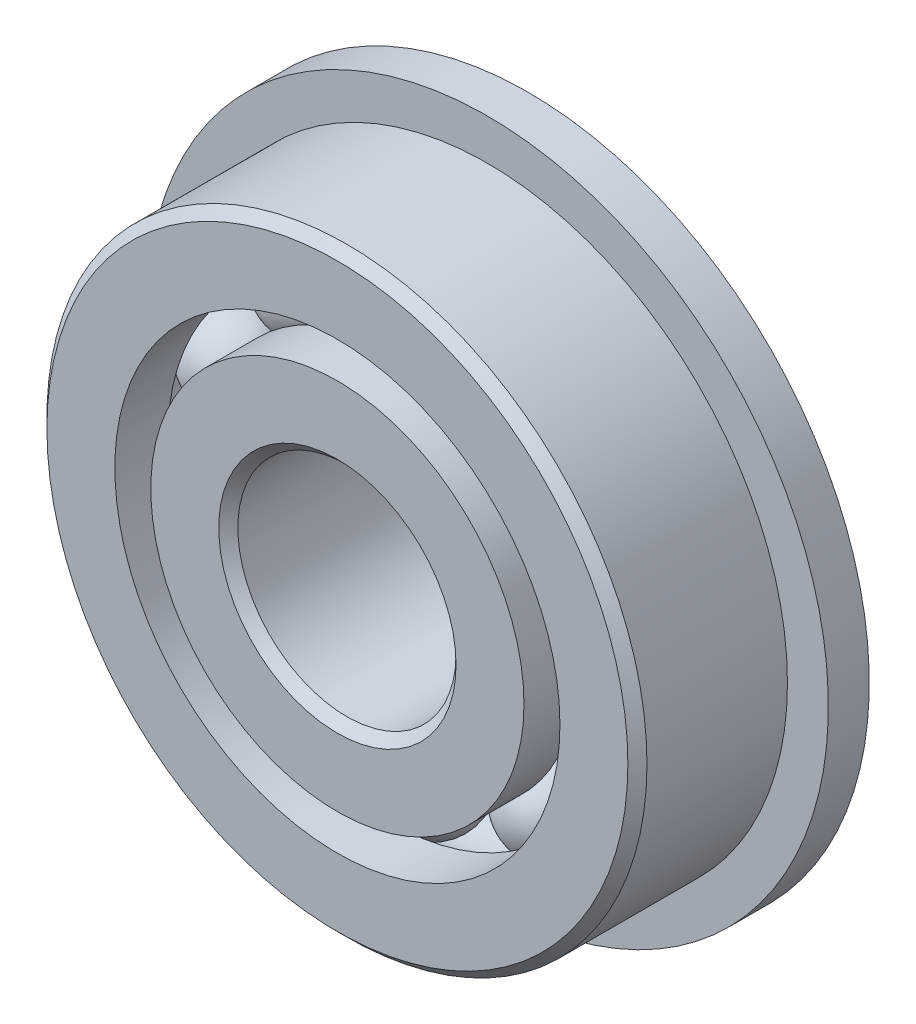
ISO-10303-21;
HEADER;
FILE_DESCRIPTION(('STEP AP214'),'2;1');
FILE_NAME('part.step','',(''),(''),'','','');
FILE_SCHEMA(('AUTOMOTIVE_DESIGN { 1 0 10303 214 1 1 1 1 }'));
ENDSEC;
DATA;
#1=APPLICATION_CONTEXT('core data for automotive mechanical design processes');
#2=APPLICATION_PROTOCOL_DEFINITION('international standard','automotive_design',2000,#1);
#3=PRODUCT_CONTEXT('',#1,'mechanical');
#4=PRODUCT('Part','Part','',(#3));
#5=PRODUCT_RELATED_PRODUCT_CATEGORY('part','',(#4));
#6=PRODUCT_DEFINITION_FORMATION('','',#4);
#7=PRODUCT_DEFINITION_CONTEXT('part definition',#1,'design');
#8=PRODUCT_DEFINITION('design','',#6,#7);
#9=PRODUCT_DEFINITION_SHAPE('','',#8);
#10=(LENGTH_UNIT() NAMED_UNIT(*) SI_UNIT(.MILLI.,.METRE.));
#11=(NAMED_UNIT(*) PLANE_ANGLE_UNIT() SI_UNIT($,.RADIAN.));
#12=(NAMED_UNIT(*) SI_UNIT($,.STERADIAN.) SOLID_ANGLE_UNIT());
#13=UNCERTAINTY_MEASURE_WITH_UNIT(LENGTH_MEASURE(1.E-05),#10,'distance_accuracy_value','');
#14=(GEOMETRIC_REPRESENTATION_CONTEXT(3) GLOBAL_UNCERTAINTY_ASSIGNED_CONTEXT((#13)) GLOBAL_UNIT_ASSIGNED_CONTEXT((#10,
#11,#12)) REPRESENTATION_CONTEXT('',''));
#15=CARTESIAN_POINT('',(0.,0.,0.));
#16=DIRECTION('',(0.,0.,1.));
#17=DIRECTION('',(1.,0.,0.));
#18=AXIS2_PLACEMENT_3D('',#15,#16,#17);
#19=CARTESIAN_POINT('',(-4.40838939219347,6.06762745781216,0.));
#20=DIRECTION('',(0.,0.,1.));
#21=DIRECTION('',(-0.587785252292462,0.809016994374955,0.));
#22=AXIS2_PLACEMENT_3D('',#19,#20,#21);
#23=SPHERICAL_SURFACE('',#22,1.68952158656808);
#24=CARTESIAN_POINT('',(-4.40838939219347,6.06762745781216,1.68952158656808));
#25=VERTEX_POINT('',#24);
#26=VERTEX_LOOP('',#25);
#27=FACE_BOUND('',#26,.T.);
#28=ADVANCED_FACE('F37',(#27),#23,.T.);
#29=CLOSED_SHELL('',(#28));
#30=MANIFOLD_SOLID_BREP('B2',#29);
#31=CARTESIAN_POINT('',(-7.13292387221363,2.31762745781219,0.));
#32=DIRECTION('',(0.,0.,1.));
#33=DIRECTION('',(-0.95105651629515,0.309016994374958,0.));
#34=AXIS2_PLACEMENT_3D('',#31,#32,#33);
#35=SPHERICAL_SURFACE('',#34,1.68952158656808);
#36=CARTESIAN_POINT('',(-7.13292387221363,2.31762745781219,1.68952158656808));
#37=VERTEX_POINT('',#36);
#38=VERTEX_LOOP('',#37);
#39=FACE_BOUND('',#38,.T.);
#40=ADVANCED_FACE('F57',(#39),#35,.T.);
#41=CLOSED_SHELL('',(#40));
#42=MANIFOLD_SOLID_BREP('B6',#41);
#43=CARTESIAN_POINT('',(-7.13292387221367,-2.31762745781204,0.));
#44=DIRECTION('',(0.,0.,1.));
#45=DIRECTION('',(-0.951056516295157,-0.309016994374938,0.));
#46=AXIS2_PLACEMENT_3D('',#43,#44,#45);
#47=SPHERICAL_SURFACE('',#46,1.68952158656808);
#48=CARTESIAN_POINT('',(-7.13292387221367,-2.31762745781204,1.68952158656808));
#49=VERTEX_POINT('',#48);
#50=VERTEX_LOOP('',#49);
#51=FACE_BOUND('',#50,.T.);
#52=ADVANCED_FACE('F77',(#51),#47,.T.);
#53=CLOSED_SHELL('',(#52));
#54=MANIFOLD_SOLID_BREP('B33',#53);
#55=CARTESIAN_POINT('',(-4.4083893921936,-6.06762745781207,0.));
#56=DIRECTION('',(0.,0.,1.));
#57=DIRECTION('',(-0.58778525229248,-0.809016994374942,0.));
#58=AXIS2_PLACEMENT_3D('',#55,#56,#57);
#59=SPHERICAL_SURFACE('',#58,1.68952158656808);
#60=CARTESIAN_POINT('',(-4.4083893921936,-6.06762745781207,1.68952158656808));
#61=VERTEX_POINT('',#60);
#62=VERTEX_LOOP('',#61);
#63=FACE_BOUND('',#62,.T.);
#64=ADVANCED_FACE('F97',(#63),#59,.T.);
#65=CLOSED_SHELL('',(#64));
#66=MANIFOLD_SOLID_BREP('B53',#65);
#67=CARTESIAN_POINT('',(0.,-7.5,0.));
#68=DIRECTION('',(0.,0.,1.));
#69=DIRECTION('',(0.,-1.,0.));
#70=AXIS2_PLACEMENT_3D('',#67,#68,#69);
#71=SPHERICAL_SURFACE('',#70,1.68952158656808);
#72=CARTESIAN_POINT('',(0.,-7.5,1.68952158656808));
#73=VERTEX_POINT('',#72);
#74=VERTEX_LOOP('',#73);
#75=FACE_BOUND('',#74,.T.);
#76=ADVANCED_FACE('F117',(#75),#71,.T.);
#77=CLOSED_SHELL('',(#76));
#78=MANIFOLD_SOLID_BREP('B73',#77);
#79=CARTESIAN_POINT('',(4.40838939219351,-6.06762745781213,0.));
#80=DIRECTION('',(0.,0.,1.));
#81=DIRECTION('',(0.587785252292469,-0.809016994374951,0.));
#82=AXIS2_PLACEMENT_3D('',#79,#80,#81);
#83=SPHERICAL_SURFACE('',#82,1.68952158656808);
#84=CARTESIAN_POINT('',(4.40838939219351,-6.06762745781213,1.68952158656808));
#85=VERTEX_POINT('',#84);
#86=VERTEX_LOOP('',#85);
#87=FACE_BOUND('',#86,.T.);
#88=ADVANCED_FACE('F137',(#87),#83,.T.);
#89=CLOSED_SHELL('',(#88));
#90=MANIFOLD_SOLID_BREP('B93',#89);
#91=CARTESIAN_POINT('',(7.13292387221364,-2.31762745781214,0.));
#92=DIRECTION('',(0.,0.,1.));
#93=DIRECTION('',(0.951056516295152,-0.309016994374952,0.));
#94=AXIS2_PLACEMENT_3D('',#91,#92,#93);
#95=SPHERICAL_SURFACE('',#94,1.68952158656808);
#96=CARTESIAN_POINT('',(7.13292387221364,-2.31762745781214,1.68952158656808));
#97=VERTEX_POINT('',#96);
#98=VERTEX_LOOP('',#97);
#99=FACE_BOUND('',#98,.T.);
#100=ADVANCED_FACE('F157',(#99),#95,.T.);
#101=CLOSED_SHELL('',(#100));
#102=MANIFOLD_SOLID_BREP('B113',#101);
#103=CARTESIAN_POINT('',(7.13292387221366,2.31762745781209,0.));
#104=DIRECTION('',(0.,0.,1.));
#105=DIRECTION('',(0.951056516295155,0.309016994374945,0.));
#106=AXIS2_PLACEMENT_3D('',#103,#104,#105);
#107=SPHERICAL_SURFACE('',#106,1.68952158656808);
#108=CARTESIAN_POINT('',(7.13292387221366,2.31762745781209,1.68952158656808));
#109=VERTEX_POINT('',#108);
#110=VERTEX_LOOP('',#109);
#111=FACE_BOUND('',#110,.T.);
#112=ADVANCED_FACE('F177',(#111),#107,.T.);
#113=CLOSED_SHELL('',(#112));
#114=MANIFOLD_SOLID_BREP('B133',#113);
#115=CARTESIAN_POINT('',(4.40838939219356,6.0676274578121,0.));
#116=DIRECTION('',(0.,0.,1.));
#117=DIRECTION('',(0.587785252292474,0.809016994374947,0.));
#118=AXIS2_PLACEMENT_3D('',#115,#116,#117);
#119=SPHERICAL_SURFACE('',#118,1.68952158656808);
#120=CARTESIAN_POINT('',(4.40838939219356,6.0676274578121,1.68952158656808));
#121=VERTEX_POINT('',#120);
#122=VERTEX_LOOP('',#121);
#123=FACE_BOUND('',#122,.T.);
#124=ADVANCED_FACE('F197',(#123),#119,.T.);
#125=CLOSED_SHELL('',(#124));
#126=MANIFOLD_SOLID_BREP('B153',#125);
#127=CARTESIAN_POINT('',(0.,7.5,0.));
#128=DIRECTION('',(0.,0.,1.));
#129=DIRECTION('',(0.,1.,0.));
#130=AXIS2_PLACEMENT_3D('',#127,#128,#129);
#131=SPHERICAL_SURFACE('',#130,1.68952158656808);
#132=CARTESIAN_POINT('',(0.,7.5,1.68952158656808));
#133=VERTEX_POINT('',#132);
#134=VERTEX_LOOP('',#133);
#135=FACE_BOUND('',#134,.T.);
#136=ADVANCED_FACE('F219',(#135),#131,.T.);
#137=CLOSED_SHELL('',(#136));
#138=MANIFOLD_SOLID_BREP('B173',#137);
#139=CARTESIAN_POINT('',(0.,6.84065934065934,3.5));
#140=DIRECTION('',(0.,0.,-1.));
#141=DIRECTION('',(-1.,0.,0.));
#142=AXIS2_PLACEMENT_3D('',#139,#140,#141);
#143=PLANE('',#142);
#144=CARTESIAN_POINT('',(0.,0.,3.5));
#145=DIRECTION('',(0.,0.,1.));
#146=DIRECTION('',(1.,0.,0.));
#147=AXIS2_PLACEMENT_3D('',#144,#145,#146);
#148=CIRCLE('',#147,4.35);
#149=CARTESIAN_POINT('',(4.35,0.,3.5));
#150=VERTEX_POINT('',#149);
#151=EDGE_CURVE('E266',#150,#150,#148,.T.);
#152=ORIENTED_EDGE('',*,*,#151,.F.);
#153=EDGE_LOOP('',(#152));
#154=FACE_BOUND('',#153,.T.);
#155=CARTESIAN_POINT('',(0.,0.,3.5));
#156=DIRECTION('',(0.,0.,1.));
#157=DIRECTION('',(1.,0.,0.));
#158=AXIS2_PLACEMENT_3D('',#155,#156,#157);
#159=CIRCLE('',#158,6.84065934065934);
#160=CARTESIAN_POINT('',(6.84065934065934,0.,3.5));
#161=VERTEX_POINT('',#160);
#162=EDGE_CURVE('E218',#161,#161,#159,.T.);
#163=ORIENTED_EDGE('',*,*,#162,.T.);
#164=EDGE_LOOP('',(#163));
#165=FACE_BOUND('',#164,.T.);
#166=ADVANCED_FACE('F238',(#154,#165),#143,.F.);
#167=CARTESIAN_POINT('',(0.,0.,3.5));
#168=DIRECTION('',(0.,0.,1.));
#169=DIRECTION('',(1.,0.,0.));
#170=AXIS2_PLACEMENT_3D('',#167,#168,#169);
#171=CYLINDRICAL_SURFACE('',#170,6.84065934065934);
#172=ORIENTED_EDGE('',*,*,#162,.F.);
#173=EDGE_LOOP('',(#172));
#174=FACE_BOUND('',#173,.T.);
#175=CARTESIAN_POINT('',(0.,0.,1.55555555555556));
#176=DIRECTION('',(0.,0.,1.));
#177=DIRECTION('',(1.,0.,0.));
#178=AXIS2_PLACEMENT_3D('',#175,#176,#177);
#179=CIRCLE('',#178,6.84065934065934);
#180=CARTESIAN_POINT('',(6.84065934065934,0.,1.55555555555556));
#181=VERTEX_POINT('',#180);
#182=EDGE_CURVE('E244',#181,#181,#179,.T.);
#183=ORIENTED_EDGE('',*,*,#182,.T.);
#184=EDGE_LOOP('',(#183));
#185=FACE_BOUND('',#184,.T.);
#186=ADVANCED_FACE('F273',(#174,#185),#171,.T.);
#187=CARTESIAN_POINT('',(0.,0.,0.));
#188=DIRECTION('',(0.,0.,1.));
#189=DIRECTION('',(1.,0.,0.));
#190=AXIS2_PLACEMENT_3D('',#187,#188,#189);
#191=TOROIDAL_SURFACE('',#190,7.49999999999999,1.68952158656808);
#192=ORIENTED_EDGE('',*,*,#182,.F.);
#193=EDGE_LOOP('',(#192));
#194=FACE_BOUND('',#193,.T.);
#195=CARTESIAN_POINT('',(0.,0.,-1.55555555555556));
#196=DIRECTION('',(0.,0.,1.));
#197=DIRECTION('',(1.,0.,0.));
#198=AXIS2_PLACEMENT_3D('',#195,#196,#197);
#199=CIRCLE('',#198,6.84065934065934);
#200=CARTESIAN_POINT('',(6.84065934065934,0.,-1.55555555555556));
#201=VERTEX_POINT('',#200);
#202=EDGE_CURVE('E248',#201,#201,#199,.T.);
#203=ORIENTED_EDGE('',*,*,#202,.T.);
#204=EDGE_LOOP('',(#203));
#205=FACE_BOUND('',#204,.T.);
#206=ADVANCED_FACE('F277',(#194,#205),#191,.F.);
#207=CARTESIAN_POINT('',(0.,0.,3.5));
#208=DIRECTION('',(0.,0.,1.));
#209=DIRECTION('',(1.,0.,0.));
#210=AXIS2_PLACEMENT_3D('',#207,#208,#209);
#211=CYLINDRICAL_SURFACE('',#210,6.84065934065934);
#212=ORIENTED_EDGE('',*,*,#202,.F.);
#213=EDGE_LOOP('',(#212));
#214=FACE_BOUND('',#213,.T.);
#215=CARTESIAN_POINT('',(0.,0.,-3.5));
#216=DIRECTION('',(0.,0.,1.));
#217=DIRECTION('',(1.,0.,0.));
#218=AXIS2_PLACEMENT_3D('',#215,#216,#217);
#219=CIRCLE('',#218,6.84065934065934);
#220=CARTESIAN_POINT('',(6.84065934065934,0.,-3.5));
#221=VERTEX_POINT('',#220);
#222=EDGE_CURVE('E252',#221,#221,#219,.T.);
#223=ORIENTED_EDGE('',*,*,#222,.T.);
#224=EDGE_LOOP('',(#223));
#225=FACE_BOUND('',#224,.T.);
#226=ADVANCED_FACE('F282',(#214,#225),#211,.T.);
#227=CARTESIAN_POINT('',(0.,4.35,-3.5));
#228=DIRECTION('',(0.,0.,1.));
#229=DIRECTION('',(1.,0.,0.));
#230=AXIS2_PLACEMENT_3D('',#227,#228,#229);
#231=PLANE('',#230);
#232=ORIENTED_EDGE('',*,*,#222,.F.);
#233=EDGE_LOOP('',(#232));
#234=FACE_BOUND('',#233,.T.);
#235=CARTESIAN_POINT('',(0.,0.,-3.5));
#236=DIRECTION('',(0.,0.,1.));
#237=DIRECTION('',(1.,0.,0.));
#238=AXIS2_PLACEMENT_3D('',#235,#236,#237);
#239=CIRCLE('',#238,4.35);
#240=CARTESIAN_POINT('',(4.35,0.,-3.5));
#241=VERTEX_POINT('',#240);
#242=EDGE_CURVE('E257',#241,#241,#239,.T.);
#243=ORIENTED_EDGE('',*,*,#242,.T.);
#244=EDGE_LOOP('',(#243));
#245=FACE_BOUND('',#244,.T.);
#246=ADVANCED_FACE('F288',(#234,#245),#231,.F.);
#247=CARTESIAN_POINT('',(0.,0.,-3.15));
#248=DIRECTION('',(0.,0.,-1.));
#249=DIRECTION('',(-1.,0.,0.));
#250=AXIS2_PLACEMENT_3D('',#247,#248,#249);
#251=CONICAL_SURFACE('',#250,4.,0.785398163397448);
#252=ORIENTED_EDGE('',*,*,#242,.F.);
#253=EDGE_LOOP('',(#252));
#254=FACE_BOUND('',#253,.T.);
#255=CARTESIAN_POINT('',(0.,0.,-3.15));
#256=DIRECTION('',(0.,0.,1.));
#257=DIRECTION('',(1.,0.,0.));
#258=AXIS2_PLACEMENT_3D('',#255,#256,#257);
#259=CIRCLE('',#258,4.);
#260=CARTESIAN_POINT('',(4.,0.,-3.15));
#261=VERTEX_POINT('',#260);
#262=EDGE_CURVE('E260',#261,#261,#259,.T.);
#263=ORIENTED_EDGE('',*,*,#262,.T.);
#264=EDGE_LOOP('',(#263));
#265=FACE_BOUND('',#264,.T.);
#266=ADVANCED_FACE('F292',(#254,#265),#251,.F.);
#267=CARTESIAN_POINT('',(0.,0.,3.5));
#268=DIRECTION('',(0.,0.,1.));
#269=DIRECTION('',(1.,0.,0.));
#270=AXIS2_PLACEMENT_3D('',#267,#268,#269);
#271=CYLINDRICAL_SURFACE('',#270,4.);
#272=ORIENTED_EDGE('',*,*,#262,.F.);
#273=EDGE_LOOP('',(#272));
#274=FACE_BOUND('',#273,.T.);
#275=CARTESIAN_POINT('',(0.,0.,3.15));
#276=DIRECTION('',(0.,0.,1.));
#277=DIRECTION('',(1.,0.,0.));
#278=AXIS2_PLACEMENT_3D('',#275,#276,#277);
#279=CIRCLE('',#278,4.);
#280=CARTESIAN_POINT('',(4.,0.,3.15));
#281=VERTEX_POINT('',#280);
#282=EDGE_CURVE('E263',#281,#281,#279,.T.);
#283=ORIENTED_EDGE('',*,*,#282,.T.);
#284=EDGE_LOOP('',(#283));
#285=FACE_BOUND('',#284,.T.);
#286=ADVANCED_FACE('F296',(#274,#285),#271,.F.);
#287=CARTESIAN_POINT('',(0.,0.,3.5));
#288=DIRECTION('',(0.,0.,1.));
#289=DIRECTION('',(1.,0.,0.));
#290=AXIS2_PLACEMENT_3D('',#287,#288,#289);
#291=CONICAL_SURFACE('',#290,4.35,0.785398163397448);
#292=ORIENTED_EDGE('',*,*,#282,.F.);
#293=EDGE_LOOP('',(#292));
#294=FACE_BOUND('',#293,.T.);
#295=ORIENTED_EDGE('',*,*,#151,.T.);
#296=EDGE_LOOP('',(#295));
#297=FACE_BOUND('',#296,.T.);
#298=ADVANCED_FACE('F270',(#294,#297),#291,.F.);
#299=CLOSED_SHELL('',(#166,#186,#206,#226,#246,#266,#286,#298));
#300=MANIFOLD_SOLID_BREP('B193',#299);
#301=CARTESIAN_POINT('',(0.,0.,3.15));
#302=DIRECTION('',(0.,0.,-1.));
#303=DIRECTION('',(-1.,0.,0.));
#304=AXIS2_PLACEMENT_3D('',#301,#302,#303);
#305=CONICAL_SURFACE('',#304,11.,0.785398163397448);
#306=CARTESIAN_POINT('',(0.,0.,3.5));
#307=DIRECTION('',(0.,0.,1.));
#308=DIRECTION('',(1.,0.,0.));
#309=AXIS2_PLACEMENT_3D('',#306,#307,#308);
#310=CIRCLE('',#309,10.65);
#311=CARTESIAN_POINT('',(10.65,0.,3.5));
#312=VERTEX_POINT('',#311);
#313=EDGE_CURVE('E381',#312,#312,#310,.T.);
#314=ORIENTED_EDGE('',*,*,#313,.F.);
#315=EDGE_LOOP('',(#314));
#316=FACE_BOUND('',#315,.T.);
#317=CARTESIAN_POINT('',(0.,0.,3.15));
#318=DIRECTION('',(0.,0.,1.));
#319=DIRECTION('',(1.,0.,0.));
#320=AXIS2_PLACEMENT_3D('',#317,#318,#319);
#321=CIRCLE('',#320,11.);
#322=CARTESIAN_POINT('',(11.,0.,3.15));
#323=VERTEX_POINT('',#322);
#324=EDGE_CURVE('E237',#323,#323,#321,.T.);
#325=ORIENTED_EDGE('',*,*,#324,.T.);
#326=EDGE_LOOP('',(#325));
#327=FACE_BOUND('',#326,.T.);
#328=ADVANCED_FACE('F359',(#316,#327),#305,.T.);
#329=CARTESIAN_POINT('',(0.,0.,3.5));
#330=DIRECTION('',(0.,0.,1.));
#331=DIRECTION('',(1.,0.,0.));
#332=AXIS2_PLACEMENT_3D('',#329,#330,#331);
#333=CYLINDRICAL_SURFACE('',#332,11.);
#334=CARTESIAN_POINT('',(0.,0.,-2.));
#335=DIRECTION('',(0.,0.,1.));
#336=DIRECTION('',(1.,0.,0.));
#337=AXIS2_PLACEMENT_3D('',#334,#335,#336);
#338=CIRCLE('',#337,11.);
#339=CARTESIAN_POINT('',(11.,0.,-2.));
#340=VERTEX_POINT('',#339);
#341=EDGE_CURVE('E384',#340,#340,#338,.T.);
#342=ORIENTED_EDGE('',*,*,#341,.T.);
#343=EDGE_LOOP('',(#342));
#344=FACE_BOUND('',#343,.T.);
#345=ORIENTED_EDGE('',*,*,#324,.F.);
#346=EDGE_LOOP('',(#345));
#347=FACE_BOUND('',#346,.T.);
#348=ADVANCED_FACE('F404',(#344,#347),#333,.T.);
#349=CARTESIAN_POINT('',(0.,10.65,-3.5));
#350=DIRECTION('',(0.,0.,1.));
#351=DIRECTION('',(1.,0.,0.));
#352=AXIS2_PLACEMENT_3D('',#349,#350,#351);
#353=PLANE('',#352);
#354=CARTESIAN_POINT('',(0.,0.,-3.5));
#355=DIRECTION('',(0.,0.,1.));
#356=DIRECTION('',(1.,0.,0.));
#357=AXIS2_PLACEMENT_3D('',#354,#355,#356);
#358=CIRCLE('',#357,8.15934065934066);
#359=CARTESIAN_POINT('',(8.15934065934066,0.,-3.5));
#360=VERTEX_POINT('',#359);
#361=EDGE_CURVE('E365',#360,#360,#358,.T.);
#362=ORIENTED_EDGE('',*,*,#361,.T.);
#363=EDGE_LOOP('',(#362));
#364=FACE_BOUND('',#363,.T.);
#365=CARTESIAN_POINT('',(0.,0.,-3.5));
#366=DIRECTION('',(0.,0.,-1.));
#367=DIRECTION('',(-1.,0.,0.));
#368=AXIS2_PLACEMENT_3D('',#365,#366,#367);
#369=CIRCLE('',#368,12.5);
#370=CARTESIAN_POINT('',(-12.5,0.,-3.5));
#371=VERTEX_POINT('',#370);
#372=EDGE_CURVE('E387',#371,#371,#369,.T.);
#373=ORIENTED_EDGE('',*,*,#372,.T.);
#374=EDGE_LOOP('',(#373));
#375=FACE_BOUND('',#374,.T.);
#376=ADVANCED_FACE('F407',(#364,#375),#353,.F.);
#377=CARTESIAN_POINT('',(0.,0.,3.5));
#378=DIRECTION('',(0.,0.,1.));
#379=DIRECTION('',(1.,0.,0.));
#380=AXIS2_PLACEMENT_3D('',#377,#378,#379);
#381=CYLINDRICAL_SURFACE('',#380,8.15934065934066);
#382=CARTESIAN_POINT('',(0.,0.,-1.55555555555556));
#383=DIRECTION('',(0.,0.,1.));
#384=DIRECTION('',(1.,0.,0.));
#385=AXIS2_PLACEMENT_3D('',#382,#383,#384);
#386=CIRCLE('',#385,8.15934065934066);
#387=CARTESIAN_POINT('',(8.15934065934066,0.,-1.55555555555556));
#388=VERTEX_POINT('',#387);
#389=EDGE_CURVE('E369',#388,#388,#386,.T.);
#390=ORIENTED_EDGE('',*,*,#389,.T.);
#391=EDGE_LOOP('',(#390));
#392=FACE_BOUND('',#391,.T.);
#393=ORIENTED_EDGE('',*,*,#361,.F.);
#394=EDGE_LOOP('',(#393));
#395=FACE_BOUND('',#394,.T.);
#396=ADVANCED_FACE('F412',(#392,#395),#381,.F.);
#397=CARTESIAN_POINT('',(0.,0.,0.));
#398=DIRECTION('',(0.,0.,1.));
#399=DIRECTION('',(1.,0.,0.));
#400=AXIS2_PLACEMENT_3D('',#397,#398,#399);
#401=TOROIDAL_SURFACE('',#400,7.5,1.68952158656808);
#402=ORIENTED_EDGE('',*,*,#389,.F.);
#403=EDGE_LOOP('',(#402));
#404=FACE_BOUND('',#403,.T.);
#405=CARTESIAN_POINT('',(0.,0.,1.55555555555556));
#406=DIRECTION('',(0.,0.,1.));
#407=DIRECTION('',(1.,0.,0.));
#408=AXIS2_PLACEMENT_3D('',#405,#406,#407);
#409=CIRCLE('',#408,8.15934065934066);
#410=CARTESIAN_POINT('',(8.15934065934066,0.,1.55555555555556));
#411=VERTEX_POINT('',#410);
#412=EDGE_CURVE('E373',#411,#411,#409,.T.);
#413=ORIENTED_EDGE('',*,*,#412,.T.);
#414=EDGE_LOOP('',(#413));
#415=FACE_BOUND('',#414,.T.);
#416=ADVANCED_FACE('F418',(#404,#415),#401,.F.);
#417=CARTESIAN_POINT('',(0.,0.,3.5));
#418=DIRECTION('',(0.,0.,1.));
#419=DIRECTION('',(1.,0.,0.));
#420=AXIS2_PLACEMENT_3D('',#417,#418,#419);
#421=CYLINDRICAL_SURFACE('',#420,8.15934065934066);
#422=ORIENTED_EDGE('',*,*,#412,.F.);
#423=EDGE_LOOP('',(#422));
#424=FACE_BOUND('',#423,.T.);
#425=CARTESIAN_POINT('',(0.,0.,3.5));
#426=DIRECTION('',(0.,0.,1.));
#427=DIRECTION('',(1.,0.,0.));
#428=AXIS2_PLACEMENT_3D('',#425,#426,#427);
#429=CIRCLE('',#428,8.15934065934066);
#430=CARTESIAN_POINT('',(8.15934065934066,0.,3.5));
#431=VERTEX_POINT('',#430);
#432=EDGE_CURVE('E378',#431,#431,#429,.T.);
#433=ORIENTED_EDGE('',*,*,#432,.T.);
#434=EDGE_LOOP('',(#433));
#435=FACE_BOUND('',#434,.T.);
#436=ADVANCED_FACE('F422',(#424,#435),#421,.F.);
#437=CARTESIAN_POINT('',(0.,10.65,3.5));
#438=DIRECTION('',(0.,0.,-1.));
#439=DIRECTION('',(-1.,0.,0.));
#440=AXIS2_PLACEMENT_3D('',#437,#438,#439);
#441=PLANE('',#440);
#442=ORIENTED_EDGE('',*,*,#432,.F.);
#443=EDGE_LOOP('',(#442));
#444=FACE_BOUND('',#443,.T.);
#445=ORIENTED_EDGE('',*,*,#313,.T.);
#446=EDGE_LOOP('',(#445));
#447=FACE_BOUND('',#446,.T.);
#448=ADVANCED_FACE('F400',(#444,#447),#441,.F.);
#449=CARTESIAN_POINT('',(0.,8.15934065934066,-2.));
#450=DIRECTION('',(0.,0.,1.));
#451=DIRECTION('',(1.,0.,0.));
#452=AXIS2_PLACEMENT_3D('',#449,#450,#451);
#453=PLANE('',#452);
#454=CARTESIAN_POINT('',(0.,0.,-2.));
#455=DIRECTION('',(0.,0.,-1.));
#456=DIRECTION('',(-1.,0.,0.));
#457=AXIS2_PLACEMENT_3D('',#454,#455,#456);
#458=CIRCLE('',#457,12.5);
#459=CARTESIAN_POINT('',(-12.5,0.,-2.));
#460=VERTEX_POINT('',#459);
#461=EDGE_CURVE('E390',#460,#460,#458,.T.);
#462=ORIENTED_EDGE('',*,*,#461,.F.);
#463=EDGE_LOOP('',(#462));
#464=FACE_BOUND('',#463,.T.);
#465=ORIENTED_EDGE('',*,*,#341,.F.);
#466=EDGE_LOOP('',(#465));
#467=FACE_BOUND('',#466,.T.);
#468=ADVANCED_FACE('F397',(#464,#467),#453,.T.);
#469=CARTESIAN_POINT('',(0.,0.,-3.5));
#470=DIRECTION('',(0.,0.,-1.));
#471=DIRECTION('',(-1.,0.,0.));
#472=AXIS2_PLACEMENT_3D('',#469,#470,#471);
#473=CYLINDRICAL_SURFACE('',#472,12.5);
#474=ORIENTED_EDGE('',*,*,#461,.T.);
#475=EDGE_LOOP('',(#474));
#476=FACE_BOUND('',#475,.T.);
#477=ORIENTED_EDGE('',*,*,#372,.F.);
#478=EDGE_LOOP('',(#477));
#479=FACE_BOUND('',#478,.T.);
#480=ADVANCED_FACE('F394',(#476,#479),#473,.T.);
#481=CLOSED_SHELL('',(#328,#348,#376,#396,#416,#436,#448,#468,#480));
#482=MANIFOLD_SOLID_BREP('B213',#481);
#483=ADVANCED_BREP_SHAPE_REPRESENTATION('',(#18,#30,#42,#54,#66,#78,#90,#102,#114,#126,#138,
#300,#482),#14);
#484=SHAPE_DEFINITION_REPRESENTATION(#9,#483);
ENDSEC;
END-ISO-10303-21;
